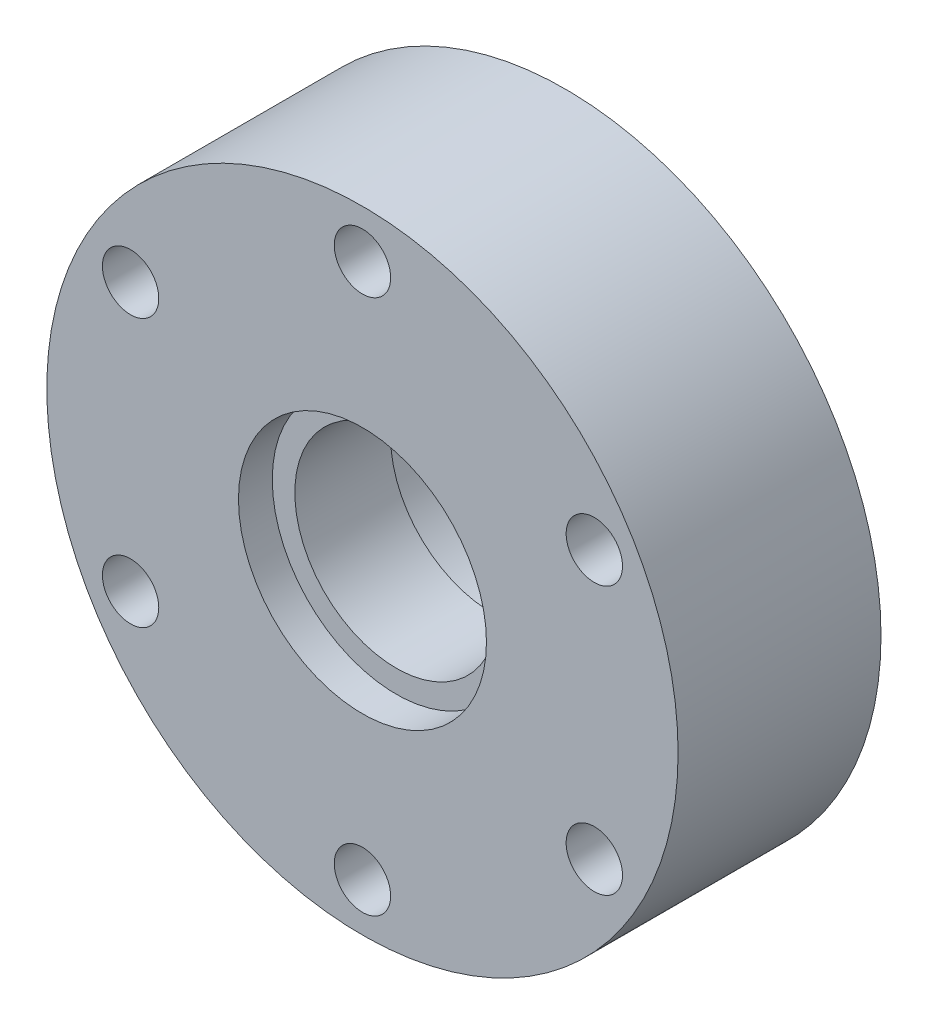
ISO-10303-21;
HEADER;
FILE_DESCRIPTION(('STEP AP214'),'2;1');
FILE_NAME('part.step','',(''),(''),'','','');
FILE_SCHEMA(('AUTOMOTIVE_DESIGN { 1 0 10303 214 1 1 1 1 }'));
ENDSEC;
DATA;
#1=APPLICATION_CONTEXT('core data for automotive mechanical design processes');
#2=APPLICATION_PROTOCOL_DEFINITION('international standard','automotive_design',2000,#1);
#3=PRODUCT_CONTEXT('',#1,'mechanical');
#4=PRODUCT('Part','Part','',(#3));
#5=PRODUCT_RELATED_PRODUCT_CATEGORY('part','',(#4));
#6=PRODUCT_DEFINITION_FORMATION('','',#4);
#7=PRODUCT_DEFINITION_CONTEXT('part definition',#1,'design');
#8=PRODUCT_DEFINITION('design','',#6,#7);
#9=PRODUCT_DEFINITION_SHAPE('','',#8);
#10=(LENGTH_UNIT() NAMED_UNIT(*) SI_UNIT(.MILLI.,.METRE.));
#11=(NAMED_UNIT(*) PLANE_ANGLE_UNIT() SI_UNIT($,.RADIAN.));
#12=(NAMED_UNIT(*) SI_UNIT($,.STERADIAN.) SOLID_ANGLE_UNIT());
#13=UNCERTAINTY_MEASURE_WITH_UNIT(LENGTH_MEASURE(1.E-05),#10,'distance_accuracy_value','');
#14=(GEOMETRIC_REPRESENTATION_CONTEXT(3) GLOBAL_UNCERTAINTY_ASSIGNED_CONTEXT((#13)) GLOBAL_UNIT_ASSIGNED_CONTEXT((#10,
#11,#12)) REPRESENTATION_CONTEXT('',''));
#15=CARTESIAN_POINT('',(0.,0.,0.));
#16=DIRECTION('',(0.,0.,1.));
#17=DIRECTION('',(1.,0.,0.));
#18=AXIS2_PLACEMENT_3D('',#15,#16,#17);
#19=CARTESIAN_POINT('',(0.,0.,-9.));
#20=DIRECTION('',(0.,0.,1.));
#21=DIRECTION('',(1.,0.,0.));
#22=AXIS2_PLACEMENT_3D('',#19,#20,#21);
#23=CYLINDRICAL_SURFACE('',#22,9.);
#24=CARTESIAN_POINT('',(0.,0.,6.));
#25=DIRECTION('',(0.,0.,1.));
#26=DIRECTION('',(1.,0.,0.));
#27=AXIS2_PLACEMENT_3D('',#24,#25,#26);
#28=CIRCLE('',#27,9.);
#29=CARTESIAN_POINT('',(9.,0.,6.));
#30=VERTEX_POINT('',#29);
#31=EDGE_CURVE('E52',#30,#30,#28,.T.);
#32=ORIENTED_EDGE('',*,*,#31,.T.);
#33=EDGE_LOOP('',(#32));
#34=FACE_BOUND('',#33,.T.);
#35=CARTESIAN_POINT('',(0.,0.,-2.5));
#36=DIRECTION('',(0.,0.,-1.));
#37=DIRECTION('',(-1.,0.,0.));
#38=AXIS2_PLACEMENT_3D('',#35,#36,#37);
#39=CIRCLE('',#38,9.);
#40=CARTESIAN_POINT('',(-9.,0.,-2.5));
#41=VERTEX_POINT('',#40);
#42=EDGE_CURVE('E38',#41,#41,#39,.F.);
#43=ORIENTED_EDGE('',*,*,#42,.F.);
#44=EDGE_LOOP('',(#43));
#45=FACE_BOUND('',#44,.T.);
#46=ADVANCED_FACE('F34',(#34,#45),#23,.F.);
#47=CARTESIAN_POINT('',(0.,0.,9.));
#48=DIRECTION('',(0.,0.,-1.));
#49=DIRECTION('',(-1.,0.,0.));
#50=AXIS2_PLACEMENT_3D('',#47,#48,#49);
#51=CYLINDRICAL_SURFACE('',#50,28.);
#52=CARTESIAN_POINT('',(0.,0.,9.));
#53=DIRECTION('',(0.,0.,1.));
#54=DIRECTION('',(1.,0.,0.));
#55=AXIS2_PLACEMENT_3D('',#52,#53,#54);
#56=CIRCLE('',#55,28.);
#57=CARTESIAN_POINT('',(28.,0.,9.));
#58=VERTEX_POINT('',#57);
#59=EDGE_CURVE('E10',#58,#58,#56,.T.);
#60=ORIENTED_EDGE('',*,*,#59,.F.);
#61=EDGE_LOOP('',(#60));
#62=FACE_BOUND('',#61,.T.);
#63=CARTESIAN_POINT('',(0.,0.,-9.));
#64=DIRECTION('',(0.,0.,1.));
#65=DIRECTION('',(1.,0.,0.));
#66=AXIS2_PLACEMENT_3D('',#63,#64,#65);
#67=CIRCLE('',#66,28.);
#68=CARTESIAN_POINT('',(28.,0.,-9.));
#69=VERTEX_POINT('',#68);
#70=EDGE_CURVE('E42',#69,#69,#67,.T.);
#71=ORIENTED_EDGE('',*,*,#70,.T.);
#72=EDGE_LOOP('',(#71));
#73=FACE_BOUND('',#72,.T.);
#74=ADVANCED_FACE('F36',(#62,#73),#51,.T.);
#75=CARTESIAN_POINT('',(0.,0.,9.));
#76=DIRECTION('',(0.,0.,1.));
#77=DIRECTION('',(1.,0.,0.));
#78=AXIS2_PLACEMENT_3D('',#75,#76,#77);
#79=PLANE('',#78);
#80=CARTESIAN_POINT('',(-20.5681033398804,-11.8750000000001,9.));
#81=DIRECTION('',(0.,0.,1.));
#82=DIRECTION('',(-0.500000000000004,0.866025403784436,0.));
#83=AXIS2_PLACEMENT_3D('',#80,#81,#82);
#84=CIRCLE('',#83,2.5);
#85=CARTESIAN_POINT('',(-21.8181033398804,-9.70993649053901,9.));
#86=VERTEX_POINT('',#85);
#87=EDGE_CURVE('E75',#86,#86,#84,.T.);
#88=ORIENTED_EDGE('',*,*,#87,.F.);
#89=EDGE_LOOP('',(#88));
#90=FACE_BOUND('',#89,.T.);
#91=CARTESIAN_POINT('',(0.,-23.75,9.));
#92=DIRECTION('',(0.,0.,1.));
#93=DIRECTION('',(-1.,0.,0.));
#94=AXIS2_PLACEMENT_3D('',#91,#92,#93);
#95=CIRCLE('',#94,2.5);
#96=CARTESIAN_POINT('',(-2.5,-23.75,9.));
#97=VERTEX_POINT('',#96);
#98=EDGE_CURVE('E89',#97,#97,#95,.T.);
#99=ORIENTED_EDGE('',*,*,#98,.F.);
#100=EDGE_LOOP('',(#99));
#101=FACE_BOUND('',#100,.T.);
#102=CARTESIAN_POINT('',(20.5681033398805,-11.8749999999998,9.));
#103=DIRECTION('',(0.,0.,1.));
#104=DIRECTION('',(-0.499999999999992,-0.866025403784443,0.));
#105=AXIS2_PLACEMENT_3D('',#102,#103,#104);
#106=CIRCLE('',#105,2.5);
#107=CARTESIAN_POINT('',(19.3181033398805,-14.0400635094609,9.));
#108=VERTEX_POINT('',#107);
#109=EDGE_CURVE('E83',#108,#108,#106,.T.);
#110=ORIENTED_EDGE('',*,*,#109,.F.);
#111=EDGE_LOOP('',(#110));
#112=FACE_BOUND('',#111,.T.);
#113=CARTESIAN_POINT('',(20.5681033398803,11.8750000000002,9.));
#114=DIRECTION('',(0.,0.,1.));
#115=DIRECTION('',(0.50000000000001,-0.866025403784433,0.));
#116=AXIS2_PLACEMENT_3D('',#113,#114,#115);
#117=CIRCLE('',#116,2.5);
#118=CARTESIAN_POINT('',(21.8181033398803,9.70993649053916,9.));
#119=VERTEX_POINT('',#118);
#120=EDGE_CURVE('E76',#119,#119,#117,.T.);
#121=ORIENTED_EDGE('',*,*,#120,.F.);
#122=EDGE_LOOP('',(#121));
#123=FACE_BOUND('',#122,.T.);
#124=CARTESIAN_POINT('',(-20.5681033398804,11.875,9.));
#125=DIRECTION('',(0.,0.,1.));
#126=DIRECTION('',(0.499999999999998,0.86602540378444,0.));
#127=AXIS2_PLACEMENT_3D('',#124,#125,#126);
#128=CIRCLE('',#127,2.5);
#129=CARTESIAN_POINT('',(-19.3181033398805,14.0400635094611,9.));
#130=VERTEX_POINT('',#129);
#131=EDGE_CURVE('E67',#130,#130,#128,.T.);
#132=ORIENTED_EDGE('',*,*,#131,.F.);
#133=EDGE_LOOP('',(#132));
#134=FACE_BOUND('',#133,.T.);
#135=CARTESIAN_POINT('',(0.,23.75,9.));
#136=DIRECTION('',(0.,0.,1.));
#137=DIRECTION('',(1.,0.,0.));
#138=AXIS2_PLACEMENT_3D('',#135,#136,#137);
#139=CIRCLE('',#138,2.5);
#140=CARTESIAN_POINT('',(2.5,23.75,9.));
#141=VERTEX_POINT('',#140);
#142=EDGE_CURVE('E64',#141,#141,#139,.T.);
#143=ORIENTED_EDGE('',*,*,#142,.F.);
#144=EDGE_LOOP('',(#143));
#145=FACE_BOUND('',#144,.T.);
#146=CARTESIAN_POINT('',(0.,0.,9.));
#147=DIRECTION('',(0.,0.,1.));
#148=DIRECTION('',(1.,0.,0.));
#149=AXIS2_PLACEMENT_3D('',#146,#147,#148);
#150=CIRCLE('',#149,11.);
#151=CARTESIAN_POINT('',(11.,0.,9.));
#152=VERTEX_POINT('',#151);
#153=EDGE_CURVE('E49',#152,#152,#150,.T.);
#154=ORIENTED_EDGE('',*,*,#153,.F.);
#155=EDGE_LOOP('',(#154));
#156=FACE_BOUND('',#155,.T.);
#157=ORIENTED_EDGE('',*,*,#59,.T.);
#158=EDGE_LOOP('',(#157));
#159=FACE_BOUND('',#158,.T.);
#160=ADVANCED_FACE('F110',(#90,#101,#112,#123,#134,#145,#156,#159),#79,.T.);
#161=CARTESIAN_POINT('',(0.,0.,-9.));
#162=DIRECTION('',(0.,0.,1.));
#163=DIRECTION('',(1.,0.,0.));
#164=AXIS2_PLACEMENT_3D('',#161,#162,#163);
#165=PLANE('',#164);
#166=CARTESIAN_POINT('',(-20.5681033398804,-11.8750000000001,-9.));
#167=DIRECTION('',(0.,0.,1.));
#168=DIRECTION('',(-0.500000000000004,0.866025403784436,0.));
#169=AXIS2_PLACEMENT_3D('',#166,#167,#168);
#170=CIRCLE('',#169,2.5);
#171=CARTESIAN_POINT('',(-21.8181033398804,-9.70993649053901,-9.));
#172=VERTEX_POINT('',#171);
#173=EDGE_CURVE('E92',#172,#172,#170,.T.);
#174=ORIENTED_EDGE('',*,*,#173,.T.);
#175=EDGE_LOOP('',(#174));
#176=FACE_BOUND('',#175,.T.);
#177=CARTESIAN_POINT('',(0.,-23.75,-9.));
#178=DIRECTION('',(0.,0.,1.));
#179=DIRECTION('',(-1.,0.,0.));
#180=AXIS2_PLACEMENT_3D('',#177,#178,#179);
#181=CIRCLE('',#180,2.5);
#182=CARTESIAN_POINT('',(-2.5,-23.75,-9.));
#183=VERTEX_POINT('',#182);
#184=EDGE_CURVE('E86',#183,#183,#181,.T.);
#185=ORIENTED_EDGE('',*,*,#184,.T.);
#186=EDGE_LOOP('',(#185));
#187=FACE_BOUND('',#186,.T.);
#188=CARTESIAN_POINT('',(20.5681033398805,-11.8749999999998,-9.));
#189=DIRECTION('',(0.,0.,1.));
#190=DIRECTION('',(-0.499999999999992,-0.866025403784443,0.));
#191=AXIS2_PLACEMENT_3D('',#188,#189,#190);
#192=CIRCLE('',#191,2.5);
#193=CARTESIAN_POINT('',(19.3181033398805,-14.0400635094609,-9.));
#194=VERTEX_POINT('',#193);
#195=EDGE_CURVE('E79',#194,#194,#192,.T.);
#196=ORIENTED_EDGE('',*,*,#195,.T.);
#197=EDGE_LOOP('',(#196));
#198=FACE_BOUND('',#197,.T.);
#199=CARTESIAN_POINT('',(20.5681033398803,11.8750000000002,-9.));
#200=DIRECTION('',(0.,0.,1.));
#201=DIRECTION('',(0.50000000000001,-0.866025403784433,0.));
#202=AXIS2_PLACEMENT_3D('',#199,#200,#201);
#203=CIRCLE('',#202,2.5);
#204=CARTESIAN_POINT('',(21.8181033398803,9.70993649053916,-9.));
#205=VERTEX_POINT('',#204);
#206=EDGE_CURVE('E80',#205,#205,#203,.T.);
#207=ORIENTED_EDGE('',*,*,#206,.T.);
#208=EDGE_LOOP('',(#207));
#209=FACE_BOUND('',#208,.T.);
#210=CARTESIAN_POINT('',(-20.5681033398804,11.875,-9.));
#211=DIRECTION('',(0.,0.,1.));
#212=DIRECTION('',(0.499999999999998,0.86602540378444,0.));
#213=AXIS2_PLACEMENT_3D('',#210,#211,#212);
#214=CIRCLE('',#213,2.5);
#215=CARTESIAN_POINT('',(-19.3181033398805,14.0400635094611,-9.));
#216=VERTEX_POINT('',#215);
#217=EDGE_CURVE('E72',#216,#216,#214,.T.);
#218=ORIENTED_EDGE('',*,*,#217,.T.);
#219=EDGE_LOOP('',(#218));
#220=FACE_BOUND('',#219,.T.);
#221=CARTESIAN_POINT('',(0.,23.75,-9.));
#222=DIRECTION('',(0.,0.,1.));
#223=DIRECTION('',(1.,0.,0.));
#224=AXIS2_PLACEMENT_3D('',#221,#222,#223);
#225=CIRCLE('',#224,2.5);
#226=CARTESIAN_POINT('',(2.5,23.75,-9.));
#227=VERTEX_POINT('',#226);
#228=EDGE_CURVE('E61',#227,#227,#225,.T.);
#229=ORIENTED_EDGE('',*,*,#228,.T.);
#230=EDGE_LOOP('',(#229));
#231=FACE_BOUND('',#230,.T.);
#232=CARTESIAN_POINT('',(0.,0.,-9.));
#233=DIRECTION('',(0.,0.,-1.));
#234=DIRECTION('',(-1.,0.,0.));
#235=AXIS2_PLACEMENT_3D('',#232,#233,#234);
#236=CIRCLE('',#235,11.);
#237=CARTESIAN_POINT('',(-11.,0.,-9.));
#238=VERTEX_POINT('',#237);
#239=EDGE_CURVE('E57',#238,#238,#236,.T.);
#240=ORIENTED_EDGE('',*,*,#239,.F.);
#241=EDGE_LOOP('',(#240));
#242=FACE_BOUND('',#241,.T.);
#243=ORIENTED_EDGE('',*,*,#70,.F.);
#244=EDGE_LOOP('',(#243));
#245=FACE_BOUND('',#244,.T.);
#246=ADVANCED_FACE('F100',(#176,#187,#198,#209,#220,#231,#242,#245),#165,.F.);
#247=CARTESIAN_POINT('',(0.,0.,6.));
#248=DIRECTION('',(0.,0.,1.));
#249=DIRECTION('',(1.,0.,0.));
#250=AXIS2_PLACEMENT_3D('',#247,#248,#249);
#251=CYLINDRICAL_SURFACE('',#250,11.);
#252=CARTESIAN_POINT('',(0.,0.,6.));
#253=DIRECTION('',(0.,0.,1.));
#254=DIRECTION('',(1.,0.,0.));
#255=AXIS2_PLACEMENT_3D('',#252,#253,#254);
#256=CIRCLE('',#255,11.);
#257=CARTESIAN_POINT('',(11.,0.,6.));
#258=VERTEX_POINT('',#257);
#259=EDGE_CURVE('E47',#258,#258,#256,.T.);
#260=ORIENTED_EDGE('',*,*,#259,.F.);
#261=EDGE_LOOP('',(#260));
#262=FACE_BOUND('',#261,.T.);
#263=ORIENTED_EDGE('',*,*,#153,.T.);
#264=EDGE_LOOP('',(#263));
#265=FACE_BOUND('',#264,.T.);
#266=ADVANCED_FACE('F126',(#262,#265),#251,.F.);
#267=CARTESIAN_POINT('',(0.,0.,6.));
#268=DIRECTION('',(0.,0.,1.));
#269=DIRECTION('',(1.,0.,0.));
#270=AXIS2_PLACEMENT_3D('',#267,#268,#269);
#271=PLANE('',#270);
#272=ORIENTED_EDGE('',*,*,#31,.F.);
#273=EDGE_LOOP('',(#272));
#274=FACE_BOUND('',#273,.T.);
#275=ORIENTED_EDGE('',*,*,#259,.T.);
#276=EDGE_LOOP('',(#275));
#277=FACE_BOUND('',#276,.T.);
#278=ADVANCED_FACE('F128',(#274,#277),#271,.T.);
#279=CARTESIAN_POINT('',(0.,0.,-2.5));
#280=DIRECTION('',(0.,0.,-1.));
#281=DIRECTION('',(-1.,0.,0.));
#282=AXIS2_PLACEMENT_3D('',#279,#280,#281);
#283=PLANE('',#282);
#284=CARTESIAN_POINT('',(0.,0.,-2.5));
#285=DIRECTION('',(0.,0.,-1.));
#286=DIRECTION('',(-1.,0.,0.));
#287=AXIS2_PLACEMENT_3D('',#284,#285,#286);
#288=CIRCLE('',#287,11.);
#289=CARTESIAN_POINT('',(-11.,0.,-2.5));
#290=VERTEX_POINT('',#289);
#291=EDGE_CURVE('E60',#290,#290,#288,.T.);
#292=ORIENTED_EDGE('',*,*,#291,.T.);
#293=EDGE_LOOP('',(#292));
#294=FACE_BOUND('',#293,.T.);
#295=ORIENTED_EDGE('',*,*,#42,.T.);
#296=EDGE_LOOP('',(#295));
#297=FACE_BOUND('',#296,.T.);
#298=ADVANCED_FACE('F135',(#294,#297),#283,.T.);
#299=CARTESIAN_POINT('',(0.,0.,-2.5));
#300=DIRECTION('',(0.,0.,-1.));
#301=DIRECTION('',(-1.,0.,0.));
#302=AXIS2_PLACEMENT_3D('',#299,#300,#301);
#303=CYLINDRICAL_SURFACE('',#302,11.);
#304=ORIENTED_EDGE('',*,*,#291,.F.);
#305=EDGE_LOOP('',(#304));
#306=FACE_BOUND('',#305,.T.);
#307=ORIENTED_EDGE('',*,*,#239,.T.);
#308=EDGE_LOOP('',(#307));
#309=FACE_BOUND('',#308,.T.);
#310=ADVANCED_FACE('F148',(#306,#309),#303,.F.);
#311=CARTESIAN_POINT('',(0.,23.75,-9.));
#312=DIRECTION('',(0.,0.,1.));
#313=DIRECTION('',(1.,0.,0.));
#314=AXIS2_PLACEMENT_3D('',#311,#312,#313);
#315=CYLINDRICAL_SURFACE('',#314,2.5);
#316=ORIENTED_EDGE('',*,*,#228,.F.);
#317=EDGE_LOOP('',(#316));
#318=FACE_BOUND('',#317,.T.);
#319=ORIENTED_EDGE('',*,*,#142,.T.);
#320=EDGE_LOOP('',(#319));
#321=FACE_BOUND('',#320,.T.);
#322=ADVANCED_FACE('F151',(#318,#321),#315,.F.);
#323=CARTESIAN_POINT('',(-20.5681033398804,11.875,-9.));
#324=DIRECTION('',(0.,0.,1.));
#325=DIRECTION('',(0.499999999999998,0.86602540378444,0.));
#326=AXIS2_PLACEMENT_3D('',#323,#324,#325);
#327=CYLINDRICAL_SURFACE('',#326,2.5);
#328=ORIENTED_EDGE('',*,*,#217,.F.);
#329=EDGE_LOOP('',(#328));
#330=FACE_BOUND('',#329,.T.);
#331=ORIENTED_EDGE('',*,*,#131,.T.);
#332=EDGE_LOOP('',(#331));
#333=FACE_BOUND('',#332,.T.);
#334=ADVANCED_FACE('F158',(#330,#333),#327,.F.);
#335=CARTESIAN_POINT('',(20.5681033398803,11.8750000000002,-9.));
#336=DIRECTION('',(0.,0.,1.));
#337=DIRECTION('',(0.50000000000001,-0.866025403784433,0.));
#338=AXIS2_PLACEMENT_3D('',#335,#336,#337);
#339=CYLINDRICAL_SURFACE('',#338,2.5);
#340=ORIENTED_EDGE('',*,*,#206,.F.);
#341=EDGE_LOOP('',(#340));
#342=FACE_BOUND('',#341,.T.);
#343=ORIENTED_EDGE('',*,*,#120,.T.);
#344=EDGE_LOOP('',(#343));
#345=FACE_BOUND('',#344,.T.);
#346=ADVANCED_FACE('F162',(#342,#345),#339,.F.);
#347=CARTESIAN_POINT('',(20.5681033398805,-11.8749999999998,-9.));
#348=DIRECTION('',(0.,0.,1.));
#349=DIRECTION('',(-0.499999999999992,-0.866025403784443,0.));
#350=AXIS2_PLACEMENT_3D('',#347,#348,#349);
#351=CYLINDRICAL_SURFACE('',#350,2.5);
#352=ORIENTED_EDGE('',*,*,#195,.F.);
#353=EDGE_LOOP('',(#352));
#354=FACE_BOUND('',#353,.T.);
#355=ORIENTED_EDGE('',*,*,#109,.T.);
#356=EDGE_LOOP('',(#355));
#357=FACE_BOUND('',#356,.T.);
#358=ADVANCED_FACE('F166',(#354,#357),#351,.F.);
#359=CARTESIAN_POINT('',(0.,-23.75,-9.));
#360=DIRECTION('',(0.,0.,1.));
#361=DIRECTION('',(-1.,0.,0.));
#362=AXIS2_PLACEMENT_3D('',#359,#360,#361);
#363=CYLINDRICAL_SURFACE('',#362,2.5);
#364=ORIENTED_EDGE('',*,*,#184,.F.);
#365=EDGE_LOOP('',(#364));
#366=FACE_BOUND('',#365,.T.);
#367=ORIENTED_EDGE('',*,*,#98,.T.);
#368=EDGE_LOOP('',(#367));
#369=FACE_BOUND('',#368,.T.);
#370=ADVANCED_FACE('F106',(#366,#369),#363,.F.);
#371=CARTESIAN_POINT('',(-20.5681033398804,-11.8750000000001,-9.));
#372=DIRECTION('',(0.,0.,1.));
#373=DIRECTION('',(-0.500000000000004,0.866025403784436,0.));
#374=AXIS2_PLACEMENT_3D('',#371,#372,#373);
#375=CYLINDRICAL_SURFACE('',#374,2.5);
#376=ORIENTED_EDGE('',*,*,#173,.F.);
#377=EDGE_LOOP('',(#376));
#378=FACE_BOUND('',#377,.T.);
#379=ORIENTED_EDGE('',*,*,#87,.T.);
#380=EDGE_LOOP('',(#379));
#381=FACE_BOUND('',#380,.T.);
#382=ADVANCED_FACE('F103',(#378,#381),#375,.F.);
#383=CLOSED_SHELL('',(#46,#74,#160,#246,#266,#278,#298,#310,#322,#334,#346,#358,#370,#382));
#384=MANIFOLD_SOLID_BREP('B2',#383);
#385=ADVANCED_BREP_SHAPE_REPRESENTATION('',(#18,#384),#14);
#386=SHAPE_DEFINITION_REPRESENTATION(#9,#385);
ENDSEC;
END-ISO-10303-21;
